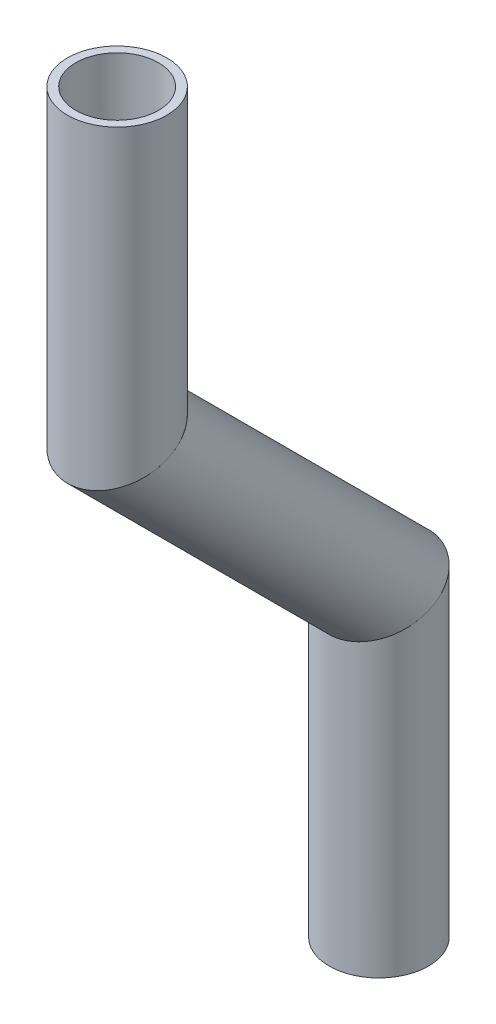
ISO-10303-21;
HEADER;
FILE_DESCRIPTION(('STEP AP214'),'2;1');
FILE_NAME('part.step','',(''),(''),'','','');
FILE_SCHEMA(('AUTOMOTIVE_DESIGN { 1 0 10303 214 1 1 1 1 }'));
ENDSEC;
DATA;
#1=APPLICATION_CONTEXT('core data for automotive mechanical design processes');
#2=APPLICATION_PROTOCOL_DEFINITION('international standard','automotive_design',2000,#1);
#3=PRODUCT_CONTEXT('',#1,'mechanical');
#4=PRODUCT('Part','Part','',(#3));
#5=PRODUCT_RELATED_PRODUCT_CATEGORY('part','',(#4));
#6=PRODUCT_DEFINITION_FORMATION('','',#4);
#7=PRODUCT_DEFINITION_CONTEXT('part definition',#1,'design');
#8=PRODUCT_DEFINITION('design','',#6,#7);
#9=PRODUCT_DEFINITION_SHAPE('','',#8);
#10=(LENGTH_UNIT() NAMED_UNIT(*) SI_UNIT(.MILLI.,.METRE.));
#11=(NAMED_UNIT(*) PLANE_ANGLE_UNIT() SI_UNIT($,.RADIAN.));
#12=(NAMED_UNIT(*) SI_UNIT($,.STERADIAN.) SOLID_ANGLE_UNIT());
#13=UNCERTAINTY_MEASURE_WITH_UNIT(LENGTH_MEASURE(1.E-05),#10,'distance_accuracy_value','');
#14=(GEOMETRIC_REPRESENTATION_CONTEXT(3) GLOBAL_UNCERTAINTY_ASSIGNED_CONTEXT((#13)) GLOBAL_UNIT_ASSIGNED_CONTEXT((#10,
#11,#12)) REPRESENTATION_CONTEXT('',''));
#15=CARTESIAN_POINT('',(0.,0.,0.));
#16=DIRECTION('',(0.,0.,1.));
#17=DIRECTION('',(1.,0.,0.));
#18=AXIS2_PLACEMENT_3D('',#15,#16,#17);
#19=CARTESIAN_POINT('',(0.,-225.856263612887,303.250213328161));
#20=DIRECTION('',(0.,1.,0.));
#21=DIRECTION('',(0.,0.,1.));
#22=AXIS2_PLACEMENT_3D('',#19,#20,#21);
#23=CYLINDRICAL_SURFACE('',#22,5.28319999999999);
#24=CARTESIAN_POINT('',(0.,-187.756263612887,303.250213328161));
#25=DIRECTION('',(0.,-1.,0.));
#26=DIRECTION('',(0.,0.,-1.));
#27=AXIS2_PLACEMENT_3D('',#24,#25,#26);
#28=CIRCLE('',#27,5.28319999999999);
#29=CARTESIAN_POINT('',(0.,-187.756263612887,297.967013328161));
#30=VERTEX_POINT('',#29);
#31=EDGE_CURVE('E54',#30,#30,#28,.T.);
#32=ORIENTED_EDGE('',*,*,#31,.F.);
#33=EDGE_LOOP('',(#32));
#34=FACE_BOUND('',#33,.T.);
#35=CARTESIAN_POINT('',(0.,-225.856263612887,303.250213328161));
#36=DIRECTION('',(0.,-0.923879532511286,-0.382683432365092));
#37=DIRECTION('',(0.,0.382683432365092,-0.923879532511286));
#38=AXIS2_PLACEMENT_3D('',#35,#36,#37);
#39=ELLIPSE('',#38,5.71849447258476,5.28319999999999);
#40=CARTESIAN_POINT('',(0.,-223.667890520157,297.967013328161));
#41=VERTEX_POINT('',#40);
#42=EDGE_CURVE('E50',#41,#41,#39,.T.);
#43=ORIENTED_EDGE('',*,*,#42,.T.);
#44=EDGE_LOOP('',(#43));
#45=FACE_BOUND('',#44,.T.);
#46=ADVANCED_FACE('F46',(#34,#45),#23,.F.);
#47=CARTESIAN_POINT('',(0.,-225.856263612887,303.250213328161));
#48=DIRECTION('',(0.,1.,0.));
#49=DIRECTION('',(0.,0.,1.));
#50=AXIS2_PLACEMENT_3D('',#47,#48,#49);
#51=CYLINDRICAL_SURFACE('',#50,6.35);
#52=CARTESIAN_POINT('',(0.,-187.756263612887,303.250213328161));
#53=DIRECTION('',(0.,-1.,0.));
#54=DIRECTION('',(0.,0.,-1.));
#55=AXIS2_PLACEMENT_3D('',#52,#53,#54);
#56=CIRCLE('',#55,6.35);
#57=CARTESIAN_POINT('',(0.,-187.756263612887,296.900213328161));
#58=VERTEX_POINT('',#57);
#59=EDGE_CURVE('E58',#58,#58,#56,.T.);
#60=ORIENTED_EDGE('',*,*,#59,.T.);
#61=EDGE_LOOP('',(#60));
#62=FACE_BOUND('',#61,.T.);
#63=CARTESIAN_POINT('',(0.,-225.856263612887,303.250213328161));
#64=DIRECTION('',(0.,-0.923879532511286,-0.382683432365092));
#65=DIRECTION('',(0.,0.382683432365092,-0.923879532511286));
#66=AXIS2_PLACEMENT_3D('',#63,#64,#65);
#67=ELLIPSE('',#66,6.8731904718567,6.35);
#68=CARTESIAN_POINT('',(0.,-223.226007491817,296.900213328161));
#69=VERTEX_POINT('',#68);
#70=EDGE_CURVE('E12',#69,#69,#67,.T.);
#71=ORIENTED_EDGE('',*,*,#70,.F.);
#72=EDGE_LOOP('',(#71));
#73=FACE_BOUND('',#72,.T.);
#74=ADVANCED_FACE('F73',(#62,#73),#51,.T.);
#75=CARTESIAN_POINT('',(0.,-187.756263612887,303.250213328161));
#76=DIRECTION('',(0.,-1.,0.));
#77=DIRECTION('',(0.,0.,-1.));
#78=AXIS2_PLACEMENT_3D('',#75,#76,#77);
#79=PLANE('',#78);
#80=ORIENTED_EDGE('',*,*,#31,.T.);
#81=EDGE_LOOP('',(#80));
#82=FACE_BOUND('',#81,.T.);
#83=ORIENTED_EDGE('',*,*,#59,.F.);
#84=EDGE_LOOP('',(#83));
#85=FACE_BOUND('',#84,.T.);
#86=ADVANCED_FACE('F69',(#82,#85),#79,.F.);
#87=CARTESIAN_POINT('',(0.,-225.856263612887,303.250213328161));
#88=DIRECTION('',(0.,-0.923879532511286,-0.382683432365092));
#89=DIRECTION('',(0.,0.382683432365092,-0.923879532511286));
#90=AXIS2_PLACEMENT_3D('',#87,#88,#89);
#91=PLANE('',#90);
#92=ORIENTED_EDGE('',*,*,#42,.F.);
#93=EDGE_LOOP('',(#92));
#94=FACE_BOUND('',#93,.T.);
#95=ORIENTED_EDGE('',*,*,#70,.T.);
#96=EDGE_LOOP('',(#95));
#97=FACE_BOUND('',#96,.T.);
#98=ADVANCED_FACE('F48',(#94,#97),#91,.T.);
#99=CLOSED_SHELL('',(#46,#74,#86,#98));
#100=MANIFOLD_SOLID_BREP('B2',#99);
#101=CARTESIAN_POINT('',(0.,-259.2961942323,269.810282708747));
#102=DIRECTION('',(0.,0.707106781186546,0.707106781186549));
#103=DIRECTION('',(0.,-0.707106781186549,0.707106781186546));
#104=AXIS2_PLACEMENT_3D('',#101,#102,#103);
#105=CYLINDRICAL_SURFACE('',#104,5.28319999999999);
#106=CARTESIAN_POINT('',(0.,-259.2961942323,269.810282708747));
#107=DIRECTION('',(0.,-0.923879532511286,-0.382683432365091));
#108=DIRECTION('',(0.,-0.382683432365091,0.923879532511286));
#109=AXIS2_PLACEMENT_3D('',#106,#107,#108);
#110=ELLIPSE('',#109,5.71849447258476,5.28319999999999);
#111=CARTESIAN_POINT('',(0.,-261.48456732503,275.093482708747));
#112=VERTEX_POINT('',#111);
#113=EDGE_CURVE('E149',#112,#112,#110,.T.);
#114=ORIENTED_EDGE('',*,*,#113,.T.);
#115=EDGE_LOOP('',(#114));
#116=FACE_BOUND('',#115,.T.);
#117=CARTESIAN_POINT('',(0.,-225.856263612887,303.25021332816));
#118=DIRECTION('',(0.,0.923879532511286,0.382683432365091));
#119=DIRECTION('',(0.,-0.382683432365091,0.923879532511286));
#120=AXIS2_PLACEMENT_3D('',#117,#118,#119);
#121=ELLIPSE('',#120,5.71849447258476,5.28319999999999);
#122=CARTESIAN_POINT('',(0.,-228.044636705616,308.53341332816));
#123=VERTEX_POINT('',#122);
#124=EDGE_CURVE('E139',#123,#123,#121,.T.);
#125=ORIENTED_EDGE('',*,*,#124,.T.);
#126=EDGE_LOOP('',(#125));
#127=FACE_BOUND('',#126,.T.);
#128=ADVANCED_FACE('F135',(#116,#127),#105,.F.);
#129=CARTESIAN_POINT('',(0.,-259.2961942323,269.810282708747));
#130=DIRECTION('',(0.,0.707106781186546,0.707106781186549));
#131=DIRECTION('',(0.,-0.707106781186549,0.707106781186546));
#132=AXIS2_PLACEMENT_3D('',#129,#130,#131);
#133=CYLINDRICAL_SURFACE('',#132,6.35);
#134=CARTESIAN_POINT('',(0.,-259.2961942323,269.810282708747));
#135=DIRECTION('',(0.,-0.923879532511286,-0.382683432365091));
#136=DIRECTION('',(0.,-0.382683432365091,0.923879532511286));
#137=AXIS2_PLACEMENT_3D('',#134,#135,#136);
#138=ELLIPSE('',#137,6.8731904718567,6.35);
#139=CARTESIAN_POINT('',(0.,-261.926450353369,276.160282708747));
#140=VERTEX_POINT('',#139);
#141=EDGE_CURVE('E143',#140,#140,#138,.T.);
#142=ORIENTED_EDGE('',*,*,#141,.F.);
#143=EDGE_LOOP('',(#142));
#144=FACE_BOUND('',#143,.T.);
#145=CARTESIAN_POINT('',(0.,-225.856263612887,303.25021332816));
#146=DIRECTION('',(0.,0.923879532511286,0.382683432365091));
#147=DIRECTION('',(0.,-0.382683432365091,0.923879532511286));
#148=AXIS2_PLACEMENT_3D('',#145,#146,#147);
#149=ELLIPSE('',#148,6.8731904718567,6.35);
#150=CARTESIAN_POINT('',(0.,-228.486519733956,309.60021332816));
#151=VERTEX_POINT('',#150);
#152=EDGE_CURVE('E45',#151,#151,#149,.T.);
#153=ORIENTED_EDGE('',*,*,#152,.F.);
#154=EDGE_LOOP('',(#153));
#155=FACE_BOUND('',#154,.T.);
#156=ADVANCED_FACE('F162',(#144,#155),#133,.T.);
#157=CARTESIAN_POINT('',(0.,-259.2961942323,269.810282708747));
#158=DIRECTION('',(0.,-0.923879532511286,-0.382683432365091));
#159=DIRECTION('',(0.,0.382683432365091,-0.923879532511286));
#160=AXIS2_PLACEMENT_3D('',#157,#158,#159);
#161=PLANE('',#160);
#162=ORIENTED_EDGE('',*,*,#113,.F.);
#163=EDGE_LOOP('',(#162));
#164=FACE_BOUND('',#163,.T.);
#165=ORIENTED_EDGE('',*,*,#141,.T.);
#166=EDGE_LOOP('',(#165));
#167=FACE_BOUND('',#166,.T.);
#168=ADVANCED_FACE('F158',(#164,#167),#161,.T.);
#169=CARTESIAN_POINT('',(0.,-225.856263612887,303.250213328161));
#170=DIRECTION('',(0.,0.923879532511286,0.382683432365091));
#171=DIRECTION('',(0.,-0.382683432365091,0.923879532511286));
#172=AXIS2_PLACEMENT_3D('',#169,#170,#171);
#173=PLANE('',#172);
#174=ORIENTED_EDGE('',*,*,#124,.F.);
#175=EDGE_LOOP('',(#174));
#176=FACE_BOUND('',#175,.T.);
#177=ORIENTED_EDGE('',*,*,#152,.T.);
#178=EDGE_LOOP('',(#177));
#179=FACE_BOUND('',#178,.T.);
#180=ADVANCED_FACE('F137',(#176,#179),#173,.T.);
#181=CLOSED_SHELL('',(#128,#156,#168,#180));
#182=MANIFOLD_SOLID_BREP('B7',#181);
#183=CARTESIAN_POINT('',(0.,-298.619674517433,269.810282708746));
#184=DIRECTION('',(0.,1.,0.));
#185=DIRECTION('',(0.,0.,1.));
#186=AXIS2_PLACEMENT_3D('',#183,#184,#185);
#187=CYLINDRICAL_SURFACE('',#186,5.28319999999999);
#188=CARTESIAN_POINT('',(0.,-298.619674517433,269.810282708746));
#189=DIRECTION('',(0.,-1.,0.));
#190=DIRECTION('',(0.,0.,-1.));
#191=AXIS2_PLACEMENT_3D('',#188,#189,#190);
#192=CIRCLE('',#191,5.28319999999999);
#193=CARTESIAN_POINT('',(0.,-298.619674517433,264.527082708746));
#194=VERTEX_POINT('',#193);
#195=EDGE_CURVE('E233',#194,#194,#192,.T.);
#196=ORIENTED_EDGE('',*,*,#195,.T.);
#197=EDGE_LOOP('',(#196));
#198=FACE_BOUND('',#197,.T.);
#199=CARTESIAN_POINT('',(0.,-259.2961942323,269.810282708746));
#200=DIRECTION('',(0.,0.923879532511286,0.382683432365092));
#201=DIRECTION('',(0.,0.382683432365092,-0.923879532511286));
#202=AXIS2_PLACEMENT_3D('',#199,#200,#201);
#203=ELLIPSE('',#202,5.71849447258477,5.28319999999999);
#204=CARTESIAN_POINT('',(0.,-257.107821139571,264.527082708746));
#205=VERTEX_POINT('',#204);
#206=EDGE_CURVE('E223',#205,#205,#203,.T.);
#207=ORIENTED_EDGE('',*,*,#206,.T.);
#208=EDGE_LOOP('',(#207));
#209=FACE_BOUND('',#208,.T.);
#210=ADVANCED_FACE('F219',(#198,#209),#187,.F.);
#211=CARTESIAN_POINT('',(0.,-298.619674517433,269.810282708746));
#212=DIRECTION('',(0.,1.,0.));
#213=DIRECTION('',(0.,0.,1.));
#214=AXIS2_PLACEMENT_3D('',#211,#212,#213);
#215=CYLINDRICAL_SURFACE('',#214,6.35);
#216=CARTESIAN_POINT('',(0.,-298.619674517433,269.810282708746));
#217=DIRECTION('',(0.,-1.,0.));
#218=DIRECTION('',(0.,0.,-1.));
#219=AXIS2_PLACEMENT_3D('',#216,#217,#218);
#220=CIRCLE('',#219,6.35);
#221=CARTESIAN_POINT('',(0.,-298.619674517433,263.460282708746));
#222=VERTEX_POINT('',#221);
#223=EDGE_CURVE('E227',#222,#222,#220,.T.);
#224=ORIENTED_EDGE('',*,*,#223,.F.);
#225=EDGE_LOOP('',(#224));
#226=FACE_BOUND('',#225,.T.);
#227=CARTESIAN_POINT('',(0.,-259.2961942323,269.810282708746));
#228=DIRECTION('',(0.,0.923879532511286,0.382683432365092));
#229=DIRECTION('',(0.,0.382683432365092,-0.923879532511286));
#230=AXIS2_PLACEMENT_3D('',#227,#228,#229);
#231=ELLIPSE('',#230,6.8731904718567,6.35);
#232=CARTESIAN_POINT('',(0.,-256.665938111231,263.460282708746));
#233=VERTEX_POINT('',#232);
#234=EDGE_CURVE('E134',#233,#233,#231,.T.);
#235=ORIENTED_EDGE('',*,*,#234,.F.);
#236=EDGE_LOOP('',(#235));
#237=FACE_BOUND('',#236,.T.);
#238=ADVANCED_FACE('F246',(#226,#237),#215,.T.);
#239=CARTESIAN_POINT('',(0.,-298.619674517433,269.810282708746));
#240=DIRECTION('',(0.,-1.,0.));
#241=DIRECTION('',(0.,0.,-1.));
#242=AXIS2_PLACEMENT_3D('',#239,#240,#241);
#243=PLANE('',#242);
#244=ORIENTED_EDGE('',*,*,#195,.F.);
#245=EDGE_LOOP('',(#244));
#246=FACE_BOUND('',#245,.T.);
#247=ORIENTED_EDGE('',*,*,#223,.T.);
#248=EDGE_LOOP('',(#247));
#249=FACE_BOUND('',#248,.T.);
#250=ADVANCED_FACE('F242',(#246,#249),#243,.T.);
#251=CARTESIAN_POINT('',(0.,-259.2961942323,269.810282708747));
#252=DIRECTION('',(0.,0.923879532511286,0.382683432365092));
#253=DIRECTION('',(0.,-0.382683432365092,0.923879532511286));
#254=AXIS2_PLACEMENT_3D('',#251,#252,#253);
#255=PLANE('',#254);
#256=ORIENTED_EDGE('',*,*,#206,.F.);
#257=EDGE_LOOP('',(#256));
#258=FACE_BOUND('',#257,.T.);
#259=ORIENTED_EDGE('',*,*,#234,.T.);
#260=EDGE_LOOP('',(#259));
#261=FACE_BOUND('',#260,.T.);
#262=ADVANCED_FACE('F221',(#258,#261),#255,.T.);
#263=CLOSED_SHELL('',(#210,#238,#250,#262));
#264=MANIFOLD_SOLID_BREP('B40',#263);
#265=ADVANCED_BREP_SHAPE_REPRESENTATION('',(#18,#100,#182,#264),#14);
#266=SHAPE_DEFINITION_REPRESENTATION(#9,#265);
ENDSEC;
END-ISO-10303-21;
